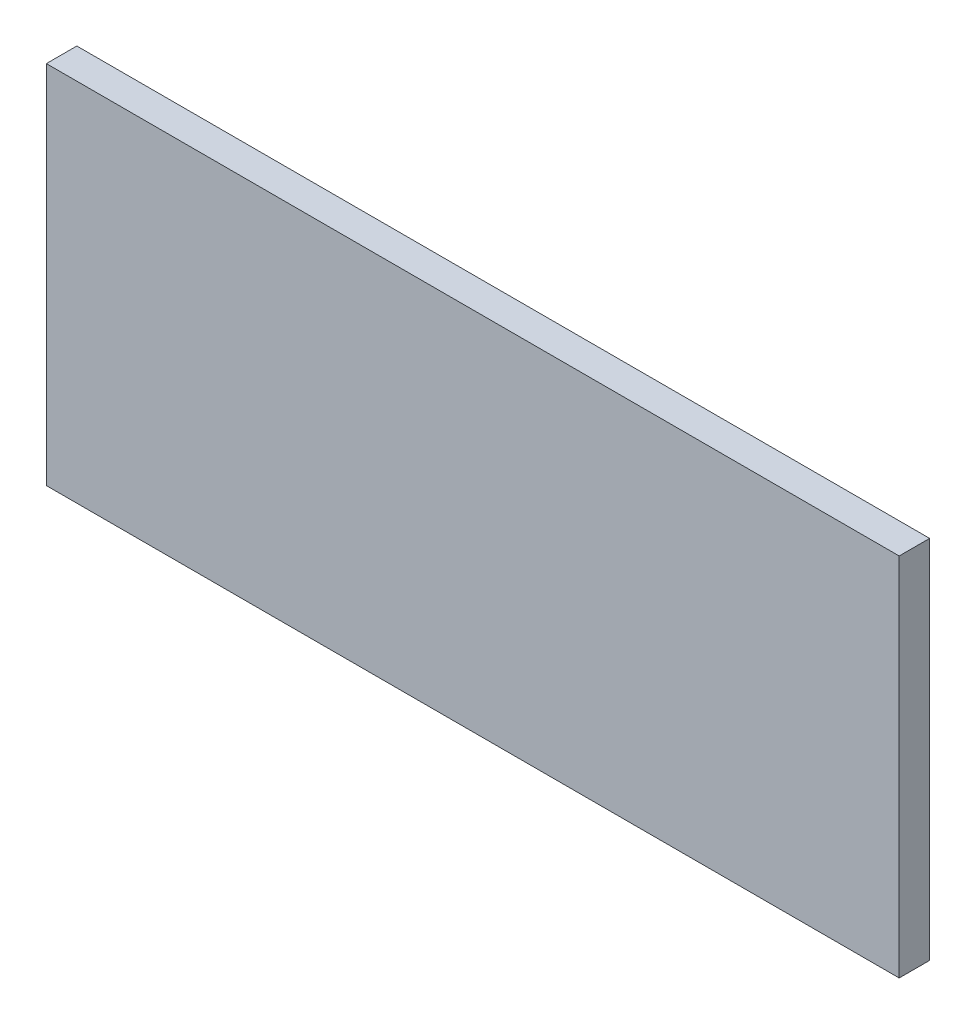
ISO-10303-21;
HEADER;
FILE_DESCRIPTION(('STEP AP214'),'2;1');
FILE_NAME('part.step','',(''),(''),'','','');
FILE_SCHEMA(('AUTOMOTIVE_DESIGN { 1 0 10303 214 1 1 1 1 }'));
ENDSEC;
DATA;
#1=APPLICATION_CONTEXT('core data for automotive mechanical design processes');
#2=APPLICATION_PROTOCOL_DEFINITION('international standard','automotive_design',2000,#1);
#3=PRODUCT_CONTEXT('',#1,'mechanical');
#4=PRODUCT('Part','Part','',(#3));
#5=PRODUCT_RELATED_PRODUCT_CATEGORY('part','',(#4));
#6=PRODUCT_DEFINITION_FORMATION('','',#4);
#7=PRODUCT_DEFINITION_CONTEXT('part definition',#1,'design');
#8=PRODUCT_DEFINITION('design','',#6,#7);
#9=PRODUCT_DEFINITION_SHAPE('','',#8);
#10=(LENGTH_UNIT() NAMED_UNIT(*) SI_UNIT(.MILLI.,.METRE.));
#11=(NAMED_UNIT(*) PLANE_ANGLE_UNIT() SI_UNIT($,.RADIAN.));
#12=(NAMED_UNIT(*) SI_UNIT($,.STERADIAN.) SOLID_ANGLE_UNIT());
#13=UNCERTAINTY_MEASURE_WITH_UNIT(LENGTH_MEASURE(1.E-05),#10,'distance_accuracy_value','');
#14=(GEOMETRIC_REPRESENTATION_CONTEXT(3) GLOBAL_UNCERTAINTY_ASSIGNED_CONTEXT((#13)) GLOBAL_UNIT_ASSIGNED_CONTEXT((#10,
#11,#12)) REPRESENTATION_CONTEXT('',''));
#15=CARTESIAN_POINT('',(0.,0.,0.));
#16=DIRECTION('',(0.,0.,1.));
#17=DIRECTION('',(1.,0.,0.));
#18=AXIS2_PLACEMENT_3D('',#15,#16,#17);
#19=CARTESIAN_POINT('',(0.,0.,6.35));
#20=DIRECTION('',(1.,0.,0.));
#21=DIRECTION('',(0.,0.,-1.));
#22=AXIS2_PLACEMENT_3D('',#19,#20,#21);
#23=PLANE('',#22);
#24=DIRECTION('',(0.,-1.,0.));
#25=VECTOR('',#24,1.);
#26=CARTESIAN_POINT('',(0.,0.,0.));
#27=LINE('',#26,#25);
#28=CARTESIAN_POINT('',(0.,76.2,0.));
#29=VERTEX_POINT('',#28);
#30=CARTESIAN_POINT('',(0.,0.,0.));
#31=VERTEX_POINT('',#30);
#32=EDGE_CURVE('E96',#29,#31,#27,.T.);
#33=ORIENTED_EDGE('',*,*,#32,.T.);
#34=DIRECTION('',(0.,0.,-1.));
#35=VECTOR('',#34,1.);
#36=CARTESIAN_POINT('',(0.,0.,6.35));
#37=LINE('',#36,#35);
#38=CARTESIAN_POINT('',(0.,0.,6.35));
#39=VERTEX_POINT('',#38);
#40=EDGE_CURVE('E11',#39,#31,#37,.T.);
#41=ORIENTED_EDGE('',*,*,#40,.F.);
#42=DIRECTION('',(0.,-1.,0.));
#43=VECTOR('',#42,1.);
#44=CARTESIAN_POINT('',(0.,0.,6.35));
#45=LINE('',#44,#43);
#46=CARTESIAN_POINT('',(0.,76.2,6.35));
#47=VERTEX_POINT('',#46);
#48=EDGE_CURVE('E84',#47,#39,#45,.T.);
#49=ORIENTED_EDGE('',*,*,#48,.F.);
#50=DIRECTION('',(0.,0.,-1.));
#51=VECTOR('',#50,1.);
#52=CARTESIAN_POINT('',(0.,76.2,6.35));
#53=LINE('',#52,#51);
#54=EDGE_CURVE('E92',#47,#29,#53,.T.);
#55=ORIENTED_EDGE('',*,*,#54,.T.);
#56=EDGE_LOOP('',(#33,#41,#49,#55));
#57=FACE_BOUND('',#56,.T.);
#58=ADVANCED_FACE('F33',(#57),#23,.F.);
#59=CARTESIAN_POINT('',(0.,0.,6.35));
#60=DIRECTION('',(0.,1.,0.));
#61=DIRECTION('',(0.,0.,1.));
#62=AXIS2_PLACEMENT_3D('',#59,#60,#61);
#63=PLANE('',#62);
#64=DIRECTION('',(1.,0.,0.));
#65=VECTOR('',#64,1.);
#66=CARTESIAN_POINT('',(0.,0.,0.));
#67=LINE('',#66,#65);
#68=CARTESIAN_POINT('',(177.8,0.,0.));
#69=VERTEX_POINT('',#68);
#70=EDGE_CURVE('E88',#31,#69,#67,.T.);
#71=ORIENTED_EDGE('',*,*,#70,.T.);
#72=DIRECTION('',(0.,0.,-1.));
#73=VECTOR('',#72,1.);
#74=CARTESIAN_POINT('',(177.8,0.,6.35));
#75=LINE('',#74,#73);
#76=CARTESIAN_POINT('',(177.8,0.,6.35));
#77=VERTEX_POINT('',#76);
#78=EDGE_CURVE('E41',#77,#69,#75,.T.);
#79=ORIENTED_EDGE('',*,*,#78,.F.);
#80=DIRECTION('',(1.,0.,0.));
#81=VECTOR('',#80,1.);
#82=CARTESIAN_POINT('',(0.,0.,6.35));
#83=LINE('',#82,#81);
#84=EDGE_CURVE('E79',#39,#77,#83,.T.);
#85=ORIENTED_EDGE('',*,*,#84,.F.);
#86=ORIENTED_EDGE('',*,*,#40,.T.);
#87=EDGE_LOOP('',(#71,#79,#85,#86));
#88=FACE_BOUND('',#87,.T.);
#89=ADVANCED_FACE('F87',(#88),#63,.F.);
#90=CARTESIAN_POINT('',(177.8,0.,6.35));
#91=DIRECTION('',(-1.,0.,0.));
#92=DIRECTION('',(0.,0.,1.));
#93=AXIS2_PLACEMENT_3D('',#90,#91,#92);
#94=PLANE('',#93);
#95=DIRECTION('',(0.,1.,0.));
#96=VECTOR('',#95,1.);
#97=CARTESIAN_POINT('',(177.8,0.,0.));
#98=LINE('',#97,#96);
#99=CARTESIAN_POINT('',(177.8,76.2,0.));
#100=VERTEX_POINT('',#99);
#101=EDGE_CURVE('E66',#69,#100,#98,.T.);
#102=ORIENTED_EDGE('',*,*,#101,.T.);
#103=DIRECTION('',(0.,0.,-1.));
#104=VECTOR('',#103,1.);
#105=CARTESIAN_POINT('',(177.8,76.2,6.35));
#106=LINE('',#105,#104);
#107=CARTESIAN_POINT('',(177.8,76.2,6.35));
#108=VERTEX_POINT('',#107);
#109=EDGE_CURVE('E89',#108,#100,#106,.T.);
#110=ORIENTED_EDGE('',*,*,#109,.F.);
#111=DIRECTION('',(0.,1.,0.));
#112=VECTOR('',#111,1.);
#113=CARTESIAN_POINT('',(177.8,0.,6.35));
#114=LINE('',#113,#112);
#115=EDGE_CURVE('E82',#77,#108,#114,.T.);
#116=ORIENTED_EDGE('',*,*,#115,.F.);
#117=ORIENTED_EDGE('',*,*,#78,.T.);
#118=EDGE_LOOP('',(#102,#110,#116,#117));
#119=FACE_BOUND('',#118,.T.);
#120=ADVANCED_FACE('F90',(#119),#94,.F.);
#121=CARTESIAN_POINT('',(0.,76.2,6.35));
#122=DIRECTION('',(0.,-1.,0.));
#123=DIRECTION('',(0.,0.,-1.));
#124=AXIS2_PLACEMENT_3D('',#121,#122,#123);
#125=PLANE('',#124);
#126=DIRECTION('',(-1.,0.,0.));
#127=VECTOR('',#126,1.);
#128=CARTESIAN_POINT('',(0.,76.2,0.));
#129=LINE('',#128,#127);
#130=EDGE_CURVE('E72',#100,#29,#129,.T.);
#131=ORIENTED_EDGE('',*,*,#130,.T.);
#132=ORIENTED_EDGE('',*,*,#54,.F.);
#133=DIRECTION('',(-1.,0.,0.));
#134=VECTOR('',#133,1.);
#135=CARTESIAN_POINT('',(0.,76.2,6.35));
#136=LINE('',#135,#134);
#137=EDGE_CURVE('E49',#108,#47,#136,.T.);
#138=ORIENTED_EDGE('',*,*,#137,.F.);
#139=ORIENTED_EDGE('',*,*,#109,.T.);
#140=EDGE_LOOP('',(#131,#132,#138,#139));
#141=FACE_BOUND('',#140,.T.);
#142=ADVANCED_FACE('F103',(#141),#125,.F.);
#143=CARTESIAN_POINT('',(0.,0.,6.35));
#144=DIRECTION('',(0.,0.,-1.));
#145=DIRECTION('',(-1.,0.,0.));
#146=AXIS2_PLACEMENT_3D('',#143,#144,#145);
#147=PLANE('',#146);
#148=ORIENTED_EDGE('',*,*,#48,.T.);
#149=ORIENTED_EDGE('',*,*,#84,.T.);
#150=ORIENTED_EDGE('',*,*,#115,.T.);
#151=ORIENTED_EDGE('',*,*,#137,.T.);
#152=EDGE_LOOP('',(#148,#149,#150,#151));
#153=FACE_BOUND('',#152,.T.);
#154=ADVANCED_FACE('F80',(#153),#147,.F.);
#155=CARTESIAN_POINT('',(0.,0.,0.));
#156=DIRECTION('',(0.,0.,-1.));
#157=DIRECTION('',(-1.,0.,0.));
#158=AXIS2_PLACEMENT_3D('',#155,#156,#157);
#159=PLANE('',#158);
#160=ORIENTED_EDGE('',*,*,#32,.F.);
#161=ORIENTED_EDGE('',*,*,#130,.F.);
#162=ORIENTED_EDGE('',*,*,#101,.F.);
#163=ORIENTED_EDGE('',*,*,#70,.F.);
#164=EDGE_LOOP('',(#160,#161,#162,#163));
#165=FACE_BOUND('',#164,.T.);
#166=ADVANCED_FACE('F106',(#165),#159,.T.);
#167=CLOSED_SHELL('',(#58,#89,#120,#142,#154,#166));
#168=MANIFOLD_SOLID_BREP('B2',#167);
#169=ADVANCED_BREP_SHAPE_REPRESENTATION('',(#18,#168),#14);
#170=SHAPE_DEFINITION_REPRESENTATION(#9,#169);
ENDSEC;
END-ISO-10303-21;
